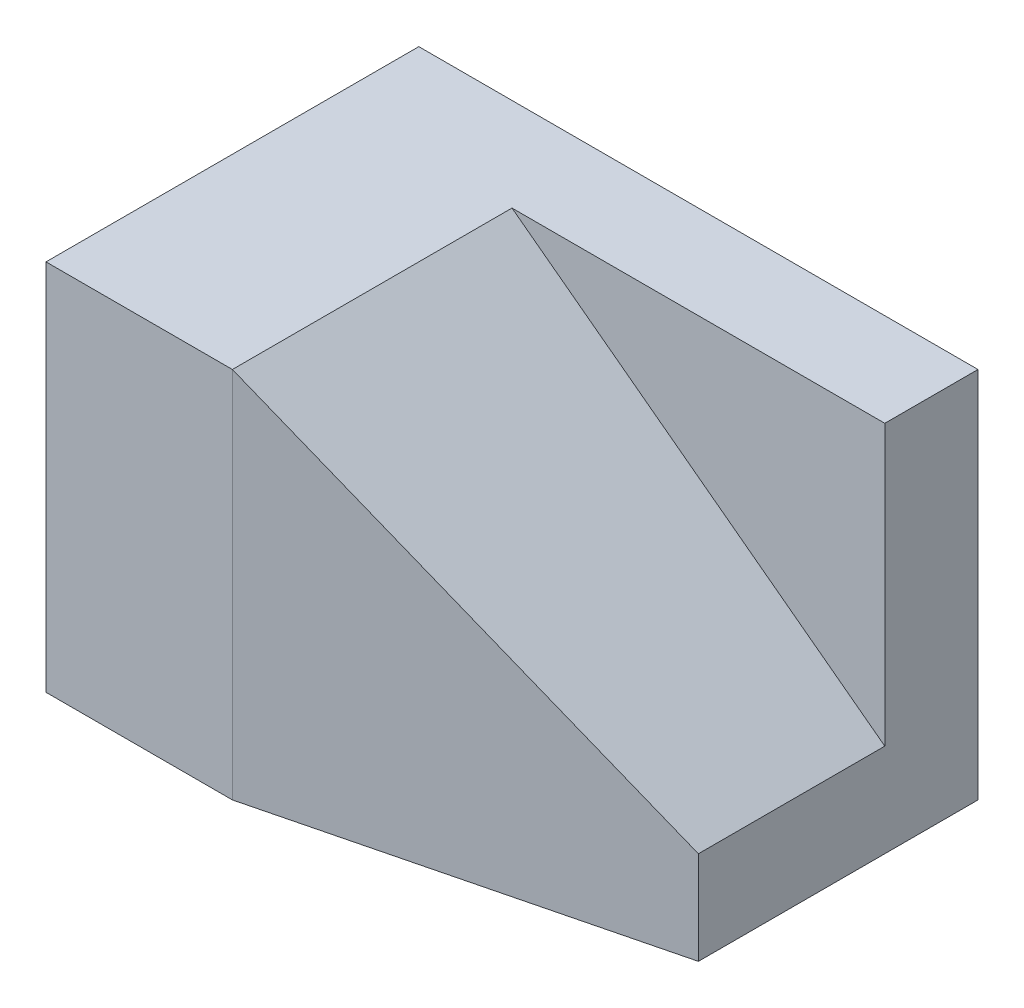
ISO-10303-21;
HEADER;
FILE_DESCRIPTION(('STEP AP214'),'2;1');
FILE_NAME('part.step','',(''),(''),'','','');
FILE_SCHEMA(('AUTOMOTIVE_DESIGN { 1 0 10303 214 1 1 1 1 }'));
ENDSEC;
DATA;
#1=APPLICATION_CONTEXT('core data for automotive mechanical design processes');
#2=APPLICATION_PROTOCOL_DEFINITION('international standard','automotive_design',2000,#1);
#3=PRODUCT_CONTEXT('',#1,'mechanical');
#4=PRODUCT('Part','Part','',(#3));
#5=PRODUCT_RELATED_PRODUCT_CATEGORY('part','',(#4));
#6=PRODUCT_DEFINITION_FORMATION('','',#4);
#7=PRODUCT_DEFINITION_CONTEXT('part definition',#1,'design');
#8=PRODUCT_DEFINITION('design','',#6,#7);
#9=PRODUCT_DEFINITION_SHAPE('','',#8);
#10=(LENGTH_UNIT() NAMED_UNIT(*) SI_UNIT(.MILLI.,.METRE.));
#11=(NAMED_UNIT(*) PLANE_ANGLE_UNIT() SI_UNIT($,.RADIAN.));
#12=(NAMED_UNIT(*) SI_UNIT($,.STERADIAN.) SOLID_ANGLE_UNIT());
#13=UNCERTAINTY_MEASURE_WITH_UNIT(LENGTH_MEASURE(1.E-05),#10,'distance_accuracy_value','');
#14=(GEOMETRIC_REPRESENTATION_CONTEXT(3) GLOBAL_UNCERTAINTY_ASSIGNED_CONTEXT((#13)) GLOBAL_UNIT_ASSIGNED_CONTEXT((#10,
#11,#12)) REPRESENTATION_CONTEXT('',''));
#15=CARTESIAN_POINT('',(0.,0.,0.));
#16=DIRECTION('',(0.,0.,1.));
#17=DIRECTION('',(1.,0.,0.));
#18=AXIS2_PLACEMENT_3D('',#15,#16,#17);
#19=CARTESIAN_POINT('',(-1.49814520402756,11.2162162162162,0.791202967673556));
#20=DIRECTION('',(-0.242535625036333,0.,-0.970142500145332));
#21=DIRECTION('',(-0.970142500145332,0.,0.242535625036333));
#22=AXIS2_PLACEMENT_3D('',#19,#20,#21);
#23=PLANE('',#22);
#24=DIRECTION('',(0.,-1.,0.));
#25=VECTOR('',#24,1.);
#26=CARTESIAN_POINT('',(1.09009009009009,11.2162162162162,0.144144144144144));
#27=LINE('',#26,#25);
#28=CARTESIAN_POINT('',(1.09009009009009,8.21621621621622,0.144144144144144));
#29=VERTEX_POINT('',#28);
#30=CARTESIAN_POINT('',(1.09009009009009,7.21621621621622,0.144144144144144));
#31=VERTEX_POINT('',#30);
#32=EDGE_CURVE('E45',#29,#31,#27,.T.);
#33=ORIENTED_EDGE('',*,*,#32,.F.);
#34=DIRECTION('',(-0.784464540552736,0.588348405414552,0.196116135138184));
#35=VECTOR('',#34,1.);
#36=CARTESIAN_POINT('',(-1.98683298683299,10.5239085239085,0.913374913374914));
#37=LINE('',#36,#35);
#38=CARTESIAN_POINT('',(-2.90990990990991,11.2162162162162,1.14414414414414));
#39=VERTEX_POINT('',#38);
#40=EDGE_CURVE('E109',#29,#39,#37,.T.);
#41=ORIENTED_EDGE('',*,*,#40,.T.);
#42=DIRECTION('',(0.,-1.,0.));
#43=VECTOR('',#42,1.);
#44=CARTESIAN_POINT('',(-2.90990990990991,11.2162162162162,1.14414414414414));
#45=LINE('',#44,#43);
#46=CARTESIAN_POINT('',(-2.90990990990991,7.21621621621622,1.14414414414414));
#47=VERTEX_POINT('',#46);
#48=EDGE_CURVE('E11',#39,#47,#45,.T.);
#49=ORIENTED_EDGE('',*,*,#48,.T.);
#50=DIRECTION('',(0.970142500145332,0.,-0.242535625036333));
#51=VECTOR('',#50,1.);
#52=CARTESIAN_POINT('',(-1.49814520402756,7.21621621621622,0.791202967673556));
#53=LINE('',#52,#51);
#54=EDGE_CURVE('E135',#47,#31,#53,.T.);
#55=ORIENTED_EDGE('',*,*,#54,.T.);
#56=EDGE_LOOP('',(#33,#41,#49,#55));
#57=FACE_BOUND('',#56,.T.);
#58=ADVANCED_FACE('F38',(#57),#23,.F.);
#59=CARTESIAN_POINT('',(1.09009009009009,11.2162162162162,-0.855855855855856));
#60=DIRECTION('',(1.,0.,0.));
#61=DIRECTION('',(0.,0.,-1.));
#62=AXIS2_PLACEMENT_3D('',#59,#60,#61);
#63=PLANE('',#62);
#64=DIRECTION('',(0.,0.,1.));
#65=VECTOR('',#64,1.);
#66=CARTESIAN_POINT('',(1.09009009009009,8.21621621621622,-1.85585585585586));
#67=LINE('',#66,#65);
#68=CARTESIAN_POINT('',(1.09009009009009,8.21621621621622,-1.85585585585586));
#69=VERTEX_POINT('',#68);
#70=EDGE_CURVE('E97',#69,#29,#67,.T.);
#71=ORIENTED_EDGE('',*,*,#70,.T.);
#72=ORIENTED_EDGE('',*,*,#32,.T.);
#73=DIRECTION('',(0.,0.,1.));
#74=VECTOR('',#73,1.);
#75=CARTESIAN_POINT('',(1.09009009009009,7.21621621621622,-0.855855855855856));
#76=LINE('',#75,#74);
#77=CARTESIAN_POINT('',(1.09009009009009,7.21621621621622,-2.85585585585586));
#78=VERTEX_POINT('',#77);
#79=EDGE_CURVE('E138',#78,#31,#76,.T.);
#80=ORIENTED_EDGE('',*,*,#79,.F.);
#81=DIRECTION('',(0.,-1.,0.));
#82=VECTOR('',#81,1.);
#83=CARTESIAN_POINT('',(1.09009009009009,11.2162162162162,-2.85585585585586));
#84=LINE('',#83,#82);
#85=CARTESIAN_POINT('',(1.09009009009009,11.2162162162162,-2.85585585585586));
#86=VERTEX_POINT('',#85);
#87=EDGE_CURVE('E132',#86,#78,#84,.T.);
#88=ORIENTED_EDGE('',*,*,#87,.F.);
#89=DIRECTION('',(0.,0.,1.));
#90=VECTOR('',#89,1.);
#91=CARTESIAN_POINT('',(1.09009009009009,11.2162162162162,-0.855855855855856));
#92=LINE('',#91,#90);
#93=CARTESIAN_POINT('',(1.09009009009009,11.2162162162162,-1.85585585585586));
#94=VERTEX_POINT('',#93);
#95=EDGE_CURVE('E136',#86,#94,#92,.T.);
#96=ORIENTED_EDGE('',*,*,#95,.T.);
#97=DIRECTION('',(0.,1.,0.));
#98=VECTOR('',#97,1.);
#99=CARTESIAN_POINT('',(1.09009009009009,8.21621621621622,-1.85585585585586));
#100=LINE('',#99,#98);
#101=EDGE_CURVE('E52',#69,#94,#100,.T.);
#102=ORIENTED_EDGE('',*,*,#101,.F.);
#103=EDGE_LOOP('',(#71,#72,#80,#88,#96,#102));
#104=FACE_BOUND('',#103,.T.);
#105=ADVANCED_FACE('F148',(#104),#63,.T.);
#106=CARTESIAN_POINT('',(-1.90990990990991,11.2162162162162,-0.855855855855856));
#107=DIRECTION('',(0.,1.,0.));
#108=DIRECTION('',(0.,0.,1.));
#109=AXIS2_PLACEMENT_3D('',#106,#107,#108);
#110=PLANE('',#109);
#111=DIRECTION('',(0.,0.,1.));
#112=VECTOR('',#111,1.);
#113=CARTESIAN_POINT('',(-2.90990990990991,11.2162162162162,-1.85585585585586));
#114=LINE('',#113,#112);
#115=CARTESIAN_POINT('',(-2.90990990990991,11.2162162162162,-1.85585585585586));
#116=VERTEX_POINT('',#115);
#117=EDGE_CURVE('E95',#116,#39,#114,.T.);
#118=ORIENTED_EDGE('',*,*,#117,.F.);
#119=DIRECTION('',(-1.,0.,0.));
#120=VECTOR('',#119,1.);
#121=CARTESIAN_POINT('',(1.09009009009009,11.2162162162162,-1.85585585585586));
#122=LINE('',#121,#120);
#123=EDGE_CURVE('E98',#94,#116,#122,.T.);
#124=ORIENTED_EDGE('',*,*,#123,.F.);
#125=ORIENTED_EDGE('',*,*,#95,.F.);
#126=DIRECTION('',(-1.,0.,0.));
#127=VECTOR('',#126,1.);
#128=CARTESIAN_POINT('',(-1.90990990990991,11.2162162162162,-2.85585585585586));
#129=LINE('',#128,#127);
#130=CARTESIAN_POINT('',(-4.90990990990991,11.2162162162162,-2.85585585585586));
#131=VERTEX_POINT('',#130);
#132=EDGE_CURVE('E116',#86,#131,#129,.T.);
#133=ORIENTED_EDGE('',*,*,#132,.T.);
#134=DIRECTION('',(0.,0.,1.));
#135=VECTOR('',#134,1.);
#136=CARTESIAN_POINT('',(-4.90990990990991,11.2162162162162,-0.855855855855856));
#137=LINE('',#136,#135);
#138=CARTESIAN_POINT('',(-4.90990990990991,11.2162162162162,1.14414414414414));
#139=VERTEX_POINT('',#138);
#140=EDGE_CURVE('E119',#131,#139,#137,.T.);
#141=ORIENTED_EDGE('',*,*,#140,.T.);
#142=DIRECTION('',(-1.,0.,0.));
#143=VECTOR('',#142,1.);
#144=CARTESIAN_POINT('',(-1.90990990990991,11.2162162162162,1.14414414414414));
#145=LINE('',#144,#143);
#146=EDGE_CURVE('E107',#39,#139,#145,.T.);
#147=ORIENTED_EDGE('',*,*,#146,.F.);
#148=EDGE_LOOP('',(#118,#124,#125,#133,#141,#147));
#149=FACE_BOUND('',#148,.T.);
#150=ADVANCED_FACE('F105',(#149),#110,.T.);
#151=CARTESIAN_POINT('',(-1.90990990990991,7.21621621621622,-0.855855855855856));
#152=DIRECTION('',(0.,1.,0.));
#153=DIRECTION('',(0.,0.,1.));
#154=AXIS2_PLACEMENT_3D('',#151,#152,#153);
#155=PLANE('',#154);
#156=ORIENTED_EDGE('',*,*,#54,.F.);
#157=DIRECTION('',(-1.,0.,0.));
#158=VECTOR('',#157,1.);
#159=CARTESIAN_POINT('',(-1.90990990990991,7.21621621621622,1.14414414414414));
#160=LINE('',#159,#158);
#161=CARTESIAN_POINT('',(-4.90990990990991,7.21621621621622,1.14414414414414));
#162=VERTEX_POINT('',#161);
#163=EDGE_CURVE('E114',#47,#162,#160,.T.);
#164=ORIENTED_EDGE('',*,*,#163,.T.);
#165=DIRECTION('',(0.,0.,1.));
#166=VECTOR('',#165,1.);
#167=CARTESIAN_POINT('',(-4.90990990990991,7.21621621621622,-0.855855855855856));
#168=LINE('',#167,#166);
#169=CARTESIAN_POINT('',(-4.90990990990991,7.21621621621622,-2.85585585585586));
#170=VERTEX_POINT('',#169);
#171=EDGE_CURVE('E117',#170,#162,#168,.T.);
#172=ORIENTED_EDGE('',*,*,#171,.F.);
#173=DIRECTION('',(-1.,0.,0.));
#174=VECTOR('',#173,1.);
#175=CARTESIAN_POINT('',(-1.90990990990991,7.21621621621622,-2.85585585585586));
#176=LINE('',#175,#174);
#177=EDGE_CURVE('E124',#78,#170,#176,.T.);
#178=ORIENTED_EDGE('',*,*,#177,.F.);
#179=ORIENTED_EDGE('',*,*,#79,.T.);
#180=EDGE_LOOP('',(#156,#164,#172,#178,#179));
#181=FACE_BOUND('',#180,.T.);
#182=ADVANCED_FACE('F144',(#181),#155,.F.);
#183=CARTESIAN_POINT('',(-1.90990990990991,11.2162162162162,1.14414414414414));
#184=DIRECTION('',(0.,0.,1.));
#185=DIRECTION('',(1.,0.,0.));
#186=AXIS2_PLACEMENT_3D('',#183,#184,#185);
#187=PLANE('',#186);
#188=ORIENTED_EDGE('',*,*,#163,.F.);
#189=ORIENTED_EDGE('',*,*,#48,.F.);
#190=ORIENTED_EDGE('',*,*,#146,.T.);
#191=DIRECTION('',(0.,-1.,0.));
#192=VECTOR('',#191,1.);
#193=CARTESIAN_POINT('',(-4.90990990990991,11.2162162162162,1.14414414414414));
#194=LINE('',#193,#192);
#195=EDGE_CURVE('E121',#139,#162,#194,.T.);
#196=ORIENTED_EDGE('',*,*,#195,.T.);
#197=EDGE_LOOP('',(#188,#189,#190,#196));
#198=FACE_BOUND('',#197,.T.);
#199=ADVANCED_FACE('F158',(#198),#187,.T.);
#200=CARTESIAN_POINT('',(-1.90990990990991,11.2162162162162,-2.85585585585586));
#201=DIRECTION('',(0.,0.,1.));
#202=DIRECTION('',(1.,0.,0.));
#203=AXIS2_PLACEMENT_3D('',#200,#201,#202);
#204=PLANE('',#203);
#205=ORIENTED_EDGE('',*,*,#177,.T.);
#206=DIRECTION('',(0.,-1.,0.));
#207=VECTOR('',#206,1.);
#208=CARTESIAN_POINT('',(-4.90990990990991,11.2162162162162,-2.85585585585586));
#209=LINE('',#208,#207);
#210=EDGE_CURVE('E129',#131,#170,#209,.T.);
#211=ORIENTED_EDGE('',*,*,#210,.F.);
#212=ORIENTED_EDGE('',*,*,#132,.F.);
#213=ORIENTED_EDGE('',*,*,#87,.T.);
#214=EDGE_LOOP('',(#205,#211,#212,#213));
#215=FACE_BOUND('',#214,.T.);
#216=ADVANCED_FACE('F151',(#215),#204,.F.);
#217=CARTESIAN_POINT('',(-4.90990990990991,11.2162162162162,-0.855855855855856));
#218=DIRECTION('',(1.,0.,0.));
#219=DIRECTION('',(0.,0.,-1.));
#220=AXIS2_PLACEMENT_3D('',#217,#218,#219);
#221=PLANE('',#220);
#222=ORIENTED_EDGE('',*,*,#171,.T.);
#223=ORIENTED_EDGE('',*,*,#195,.F.);
#224=ORIENTED_EDGE('',*,*,#140,.F.);
#225=ORIENTED_EDGE('',*,*,#210,.T.);
#226=EDGE_LOOP('',(#222,#223,#224,#225));
#227=FACE_BOUND('',#226,.T.);
#228=ADVANCED_FACE('F160',(#227),#221,.F.);
#229=CARTESIAN_POINT('',(-2.90990990990991,11.2162162162162,-1.85585585585586));
#230=DIRECTION('',(-0.6,-0.8,0.));
#231=DIRECTION('',(0.8,-0.6,0.));
#232=AXIS2_PLACEMENT_3D('',#229,#230,#231);
#233=PLANE('',#232);
#234=ORIENTED_EDGE('',*,*,#70,.F.);
#235=DIRECTION('',(0.8,-0.6,0.));
#236=VECTOR('',#235,1.);
#237=CARTESIAN_POINT('',(-2.90990990990991,11.2162162162162,-1.85585585585586));
#238=LINE('',#237,#236);
#239=EDGE_CURVE('E92',#116,#69,#238,.T.);
#240=ORIENTED_EDGE('',*,*,#239,.F.);
#241=ORIENTED_EDGE('',*,*,#117,.T.);
#242=ORIENTED_EDGE('',*,*,#40,.F.);
#243=EDGE_LOOP('',(#234,#240,#241,#242));
#244=FACE_BOUND('',#243,.T.);
#245=ADVANCED_FACE('F93',(#244),#233,.F.);
#246=CARTESIAN_POINT('',(-1.90990990990991,7.21621621621622,-1.85585585585586));
#247=DIRECTION('',(0.,0.,-1.));
#248=DIRECTION('',(-1.,0.,0.));
#249=AXIS2_PLACEMENT_3D('',#246,#247,#248);
#250=PLANE('',#249);
#251=ORIENTED_EDGE('',*,*,#123,.T.);
#252=ORIENTED_EDGE('',*,*,#239,.T.);
#253=ORIENTED_EDGE('',*,*,#101,.T.);
#254=EDGE_LOOP('',(#251,#252,#253));
#255=FACE_BOUND('',#254,.T.);
#256=ADVANCED_FACE('F100',(#255),#250,.F.);
#257=CLOSED_SHELL('',(#58,#105,#150,#182,#199,#216,#228,#245,#256));
#258=MANIFOLD_SOLID_BREP('B2',#257);
#259=ADVANCED_BREP_SHAPE_REPRESENTATION('',(#18,#258),#14);
#260=SHAPE_DEFINITION_REPRESENTATION(#9,#259);
ENDSEC;
END-ISO-10303-21;
